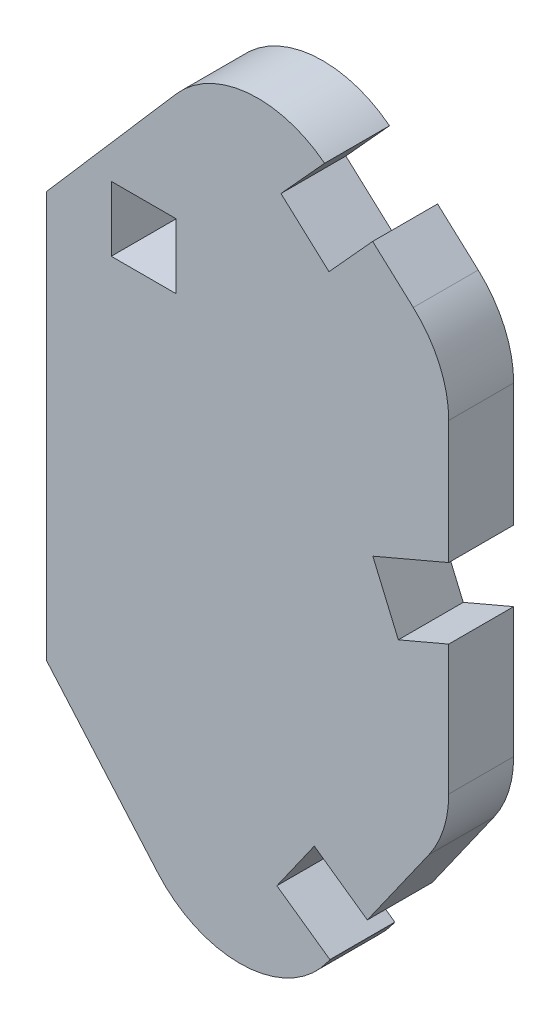
ISO-10303-21;
HEADER;
FILE_DESCRIPTION(('STEP AP214'),'2;1');
FILE_NAME('part.step','',(''),(''),'','','');
FILE_SCHEMA(('AUTOMOTIVE_DESIGN { 1 0 10303 214 1 1 1 1 }'));
ENDSEC;
DATA;
#1=APPLICATION_CONTEXT('core data for automotive mechanical design processes');
#2=APPLICATION_PROTOCOL_DEFINITION('international standard','automotive_design',2000,#1);
#3=PRODUCT_CONTEXT('',#1,'mechanical');
#4=PRODUCT('Part','Part','',(#3));
#5=PRODUCT_RELATED_PRODUCT_CATEGORY('part','',(#4));
#6=PRODUCT_DEFINITION_FORMATION('','',#4);
#7=PRODUCT_DEFINITION_CONTEXT('part definition',#1,'design');
#8=PRODUCT_DEFINITION('design','',#6,#7);
#9=PRODUCT_DEFINITION_SHAPE('','',#8);
#10=(LENGTH_UNIT() NAMED_UNIT(*) SI_UNIT(.MILLI.,.METRE.));
#11=(NAMED_UNIT(*) PLANE_ANGLE_UNIT() SI_UNIT($,.RADIAN.));
#12=(NAMED_UNIT(*) SI_UNIT($,.STERADIAN.) SOLID_ANGLE_UNIT());
#13=UNCERTAINTY_MEASURE_WITH_UNIT(LENGTH_MEASURE(1.E-05),#10,'distance_accuracy_value','');
#14=(GEOMETRIC_REPRESENTATION_CONTEXT(3) GLOBAL_UNCERTAINTY_ASSIGNED_CONTEXT((#13)) GLOBAL_UNIT_ASSIGNED_CONTEXT((#10,
#11,#12)) REPRESENTATION_CONTEXT('',''));
#15=CARTESIAN_POINT('',(0.,0.,0.));
#16=DIRECTION('',(0.,0.,1.));
#17=DIRECTION('',(1.,0.,0.));
#18=AXIS2_PLACEMENT_3D('',#15,#16,#17);
#19=CARTESIAN_POINT('',(0.,0.,-1.524));
#20=DIRECTION('',(0.,0.,1.));
#21=DIRECTION('',(-1.,0.,0.));
#22=AXIS2_PLACEMENT_3D('',#19,#20,#21);
#23=PLANE('',#22);
#24=DIRECTION('',(0.655594715544855,-0.755112951120334,0.));
#25=VECTOR('',#24,1.);
#26=CARTESIAN_POINT('',(1.524,-10.4973080234893,-1.524));
#27=LINE('',#26,#25);
#28=CARTESIAN_POINT('',(1.524,-10.4973080234893,-1.524));
#29=VERTEX_POINT('',#28);
#30=CARTESIAN_POINT('',(4.14460846819319,-13.5157206909918,-1.524));
#31=VERTEX_POINT('',#30);
#32=EDGE_CURVE('E241',#29,#31,#27,.T.);
#33=ORIENTED_EDGE('',*,*,#32,.F.);
#34=DIRECTION('',(0.,-1.,0.));
#35=VECTOR('',#34,1.);
#36=CARTESIAN_POINT('',(1.524,-10.4973080234893,-1.524));
#37=LINE('',#36,#35);
#38=CARTESIAN_POINT('',(1.524,-0.972308023489268,-1.524));
#39=VERTEX_POINT('',#38);
#40=EDGE_CURVE('E288',#39,#29,#37,.T.);
#41=ORIENTED_EDGE('',*,*,#40,.F.);
#42=DIRECTION('',(-0.655594715544855,-0.755112951120334,0.));
#43=VECTOR('',#42,1.);
#44=CARTESIAN_POINT('',(1.524,-0.972308023489268,-1.524));
#45=LINE('',#44,#43);
#46=CARTESIAN_POINT('',(4.57080902595248,2.53700176887991,-1.524));
#47=VERTEX_POINT('',#46);
#48=EDGE_CURVE('E286',#47,#39,#45,.T.);
#49=ORIENTED_EDGE('',*,*,#48,.F.);
#50=CARTESIAN_POINT('',(6.48879592179813,0.87179119139598,-1.524));
#51=DIRECTION('',(0.,0.,-1.));
#52=DIRECTION('',(-1.,0.,0.));
#53=AXIS2_PLACEMENT_3D('',#50,#51,#52);
#54=CIRCLE('',#53,2.54);
#55=CARTESIAN_POINT('',(8.05554168634904,2.8710179692433,-1.524));
#56=VERTEX_POINT('',#55);
#57=EDGE_CURVE('E386',#56,#47,#54,.F.);
#58=ORIENTED_EDGE('',*,*,#57,.F.);
#59=DIRECTION('',(0.672440925260352,0.740150796821162,0.));
#60=VECTOR('',#59,1.);
#61=CARTESIAN_POINT('',(8.05554168634904,2.8710179692433,-1.524));
#62=LINE('',#61,#60);
#63=CARTESIAN_POINT('',(7.03074171625227,1.74302815488784,-1.524));
#64=VERTEX_POINT('',#63);
#65=EDGE_CURVE('E283',#64,#56,#62,.T.);
#66=ORIENTED_EDGE('',*,*,#65,.F.);
#67=DIRECTION('',(-0.740150796821163,0.672440925260351,0.));
#68=VECTOR('',#67,1.);
#69=CARTESIAN_POINT('',(7.03074171625227,1.74302815488784,-1.524));
#70=LINE('',#69,#68);
#71=CARTESIAN_POINT('',(8.15873153060772,0.718228184791068,-1.524));
#72=VERTEX_POINT('',#71);
#73=EDGE_CURVE('E280',#72,#64,#70,.T.);
#74=ORIENTED_EDGE('',*,*,#73,.F.);
#75=DIRECTION('',(-0.672440925260352,-0.740150796821163,0.));
#76=VECTOR('',#75,1.);
#77=CARTESIAN_POINT('',(9.1835315007045,1.84621799914652,-1.524));
#78=LINE('',#77,#76);
#79=CARTESIAN_POINT('',(9.1835315007045,1.84621799914652,-1.524));
#80=VERTEX_POINT('',#79);
#81=EDGE_CURVE('E277',#80,#72,#78,.T.);
#82=ORIENTED_EDGE('',*,*,#81,.F.);
#83=DIRECTION('',(-0.740150796821161,0.672440925260353,0.));
#84=VECTOR('',#83,1.);
#85=CARTESIAN_POINT('',(9.1835315007045,1.84621799914652,-1.524));
#86=LINE('',#85,#84);
#87=CARTESIAN_POINT('',(10.1375153235953,0.979505746314785,-1.524));
#88=VERTEX_POINT('',#87);
#89=EDGE_CURVE('E275',#88,#80,#86,.T.);
#90=ORIENTED_EDGE('',*,*,#89,.F.);
#91=CARTESIAN_POINT('',(8.42951537343396,-0.900477277610966,-1.524));
#92=DIRECTION('',(0.,0.,-1.));
#93=DIRECTION('',(-1.,0.,0.));
#94=AXIS2_PLACEMENT_3D('',#91,#92,#93);
#95=CIRCLE('',#94,2.54);
#96=CARTESIAN_POINT('',(10.969515373434,-0.900477277610966,-1.524));
#97=VERTEX_POINT('',#96);
#98=EDGE_CURVE('E384',#97,#88,#95,.F.);
#99=ORIENTED_EDGE('',*,*,#98,.F.);
#100=DIRECTION('',(0.,1.,0.));
#101=VECTOR('',#100,1.);
#102=CARTESIAN_POINT('',(10.969515373434,-3.78982146589221,-1.524));
#103=LINE('',#102,#101);
#104=CARTESIAN_POINT('',(10.969515373434,-3.78982146589221,-1.524));
#105=VERTEX_POINT('',#104);
#106=EDGE_CURVE('E272',#105,#97,#103,.T.);
#107=ORIENTED_EDGE('',*,*,#106,.F.);
#108=DIRECTION('',(0.919781846056085,0.392430064681162,0.));
#109=VECTOR('',#108,1.);
#110=CARTESIAN_POINT('',(10.969515373434,-3.78982146589221,-1.524));
#111=LINE('',#110,#109);
#112=CARTESIAN_POINT('',(9.18820201833848,-4.54982876344319,-1.524));
#113=VERTEX_POINT('',#112);
#114=EDGE_CURVE('E269',#113,#105,#111,.T.);
#115=ORIENTED_EDGE('',*,*,#114,.F.);
#116=DIRECTION('',(-0.392430064681162,0.919781846056084,0.));
#117=VECTOR('',#116,1.);
#118=CARTESIAN_POINT('',(9.18820201833848,-4.54982876344319,-1.524));
#119=LINE('',#118,#117);
#120=CARTESIAN_POINT('',(9.78626543691257,-5.95157629683267,-1.524));
#121=VERTEX_POINT('',#120);
#122=EDGE_CURVE('E266',#121,#113,#119,.T.);
#123=ORIENTED_EDGE('',*,*,#122,.F.);
#124=DIRECTION('',(-0.919781846056085,-0.392430064681162,0.));
#125=VECTOR('',#124,1.);
#126=CARTESIAN_POINT('',(9.78626543691257,-5.95157629683267,-1.524));
#127=LINE('',#126,#125);
#128=CARTESIAN_POINT('',(10.969515373434,-5.44673609900302,-1.524));
#129=VERTEX_POINT('',#128);
#130=EDGE_CURVE('E263',#129,#121,#127,.T.);
#131=ORIENTED_EDGE('',*,*,#130,.F.);
#132=DIRECTION('',(0.,1.,0.));
#133=VECTOR('',#132,1.);
#134=CARTESIAN_POINT('',(10.969515373434,-9.30138195350672,-1.524));
#135=LINE('',#134,#133);
#136=CARTESIAN_POINT('',(10.969515373434,-8.49557113073387,-1.524));
#137=VERTEX_POINT('',#136);
#138=EDGE_CURVE('E260',#137,#129,#135,.T.);
#139=ORIENTED_EDGE('',*,*,#138,.F.);
#140=CARTESIAN_POINT('',(8.42951537343396,-8.49557113073387,-1.524));
#141=DIRECTION('',(0.,0.,-1.));
#142=DIRECTION('',(-1.,0.,0.));
#143=AXIS2_PLACEMENT_3D('',#140,#141,#142);
#144=CIRCLE('',#143,2.54);
#145=CARTESIAN_POINT('',(10.5049844747504,-9.95982111262931,-1.524));
#146=VERTEX_POINT('',#145);
#147=EDGE_CURVE('E388',#146,#137,#144,.F.);
#148=ORIENTED_EDGE('',*,*,#147,.F.);
#149=DIRECTION('',(0.576476370824979,0.817113819415913,0.));
#150=VECTOR('',#149,1.);
#151=CARTESIAN_POINT('',(9.0588115880954,-12.009667230796,-1.524));
#152=LINE('',#151,#150);
#153=CARTESIAN_POINT('',(9.0588115880954,-12.009667230796,-1.524));
#154=VERTEX_POINT('',#153);
#155=EDGE_CURVE('E257',#154,#146,#152,.T.);
#156=ORIENTED_EDGE('',*,*,#155,.F.);
#157=DIRECTION('',(0.817113819415912,-0.57647637082498,0.));
#158=VECTOR('',#157,1.);
#159=CARTESIAN_POINT('',(9.0588115880954,-12.009667230796,-1.524));
#160=LINE('',#159,#158);
#161=CARTESIAN_POINT('',(7.81353012730556,-11.1311172416587,-1.524));
#162=VERTEX_POINT('',#161);
#163=EDGE_CURVE('E254',#162,#154,#160,.T.);
#164=ORIENTED_EDGE('',*,*,#163,.F.);
#165=DIRECTION('',(0.57647637082498,0.817113819415913,0.));
#166=VECTOR('',#165,1.);
#167=CARTESIAN_POINT('',(7.81353012730556,-11.1311172416587,-1.524));
#168=LINE('',#167,#166);
#169=CARTESIAN_POINT('',(6.93498013816829,-12.3763987024485,-1.524));
#170=VERTEX_POINT('',#169);
#171=EDGE_CURVE('E251',#170,#162,#168,.T.);
#172=ORIENTED_EDGE('',*,*,#171,.F.);
#173=DIRECTION('',(-0.817113819415912,0.57647637082498,0.));
#174=VECTOR('',#173,1.);
#175=CARTESIAN_POINT('',(8.18026159895814,-13.2549486915858,-1.524));
#176=LINE('',#175,#174);
#177=CARTESIAN_POINT('',(8.18026159895814,-13.2549486915858,-1.524));
#178=VERTEX_POINT('',#177);
#179=EDGE_CURVE('E248',#178,#170,#176,.T.);
#180=ORIENTED_EDGE('',*,*,#179,.F.);
#181=DIRECTION('',(0.576476370824979,0.817113819415913,0.));
#182=VECTOR('',#181,1.);
#183=CARTESIAN_POINT('',(6.26955781361958,-15.9632339688751,-1.524));
#184=LINE('',#183,#182);
#185=CARTESIAN_POINT('',(8.13806446535526,-13.3147600954033,-1.524));
#186=VERTEX_POINT('',#185);
#187=EDGE_CURVE('E244',#186,#178,#184,.T.);
#188=ORIENTED_EDGE('',*,*,#187,.F.);
#189=CARTESIAN_POINT('',(6.06259536403884,-11.8505101135079,-1.524));
#190=DIRECTION('',(0.,0.,-1.));
#191=DIRECTION('',(-1.,0.,0.));
#192=AXIS2_PLACEMENT_3D('',#189,#190,#191);
#193=CIRCLE('',#192,2.54);
#194=EDGE_CURVE('E391',#31,#186,#193,.F.);
#195=ORIENTED_EDGE('',*,*,#194,.F.);
#196=EDGE_LOOP('',(#33,#41,#49,#58,#66,#74,#82,#90,#99,#107,#115,#123,#131,#139,#148,#156,#164,
#172,#180,#188,#195));
#197=FACE_BOUND('',#196,.T.);
#198=DIRECTION('',(0.,1.,0.));
#199=VECTOR('',#198,1.);
#200=CARTESIAN_POINT('',(4.572,0.,-1.524));
#201=LINE('',#200,#199);
#202=CARTESIAN_POINT('',(4.572,-1.524,-1.524));
#203=VERTEX_POINT('',#202);
#204=CARTESIAN_POINT('',(4.572,0.,-1.524));
#205=VERTEX_POINT('',#204);
#206=EDGE_CURVE('E203',#203,#205,#201,.T.);
#207=ORIENTED_EDGE('',*,*,#206,.T.);
#208=DIRECTION('',(-1.,0.,0.));
#209=VECTOR('',#208,1.);
#210=CARTESIAN_POINT('',(4.572,0.,-1.524));
#211=LINE('',#210,#209);
#212=CARTESIAN_POINT('',(3.048,0.,-1.524));
#213=VERTEX_POINT('',#212);
#214=EDGE_CURVE('E213',#205,#213,#211,.T.);
#215=ORIENTED_EDGE('',*,*,#214,.T.);
#216=DIRECTION('',(0.,-1.,0.));
#217=VECTOR('',#216,1.);
#218=CARTESIAN_POINT('',(3.048,0.,-1.524));
#219=LINE('',#218,#217);
#220=CARTESIAN_POINT('',(3.048,-1.524,-1.524));
#221=VERTEX_POINT('',#220);
#222=EDGE_CURVE('E218',#213,#221,#219,.T.);
#223=ORIENTED_EDGE('',*,*,#222,.T.);
#224=DIRECTION('',(1.,0.,0.));
#225=VECTOR('',#224,1.);
#226=CARTESIAN_POINT('',(4.572,-1.524,-1.524));
#227=LINE('',#226,#225);
#228=EDGE_CURVE('E222',#221,#203,#227,.T.);
#229=ORIENTED_EDGE('',*,*,#228,.T.);
#230=EDGE_LOOP('',(#207,#215,#223,#229));
#231=FACE_BOUND('',#230,.T.);
#232=ADVANCED_FACE('F32',(#197,#231),#23,.F.);
#233=CARTESIAN_POINT('',(0.,0.,0.));
#234=DIRECTION('',(0.,0.,1.));
#235=DIRECTION('',(-1.,0.,0.));
#236=AXIS2_PLACEMENT_3D('',#233,#234,#235);
#237=PLANE('',#236);
#238=DIRECTION('',(0.576476370824979,0.817113819415913,0.));
#239=VECTOR('',#238,1.);
#240=CARTESIAN_POINT('',(6.26955781361958,-15.9632339688751,0.));
#241=LINE('',#240,#239);
#242=CARTESIAN_POINT('',(8.13806446535526,-13.3147600954033,0.));
#243=VERTEX_POINT('',#242);
#244=CARTESIAN_POINT('',(8.18026159895814,-13.2549486915858,0.));
#245=VERTEX_POINT('',#244);
#246=EDGE_CURVE('E294',#243,#245,#241,.T.);
#247=ORIENTED_EDGE('',*,*,#246,.T.);
#248=DIRECTION('',(-0.817113819415912,0.57647637082498,0.));
#249=VECTOR('',#248,1.);
#250=CARTESIAN_POINT('',(8.18026159895814,-13.2549486915858,0.));
#251=LINE('',#250,#249);
#252=CARTESIAN_POINT('',(6.93498013816829,-12.3763987024485,0.));
#253=VERTEX_POINT('',#252);
#254=EDGE_CURVE('E297',#245,#253,#251,.T.);
#255=ORIENTED_EDGE('',*,*,#254,.T.);
#256=DIRECTION('',(0.57647637082498,0.817113819415913,0.));
#257=VECTOR('',#256,1.);
#258=CARTESIAN_POINT('',(7.81353012730556,-11.1311172416587,0.));
#259=LINE('',#258,#257);
#260=CARTESIAN_POINT('',(7.81353012730556,-11.1311172416587,0.));
#261=VERTEX_POINT('',#260);
#262=EDGE_CURVE('E300',#253,#261,#259,.T.);
#263=ORIENTED_EDGE('',*,*,#262,.T.);
#264=DIRECTION('',(0.817113819415912,-0.57647637082498,0.));
#265=VECTOR('',#264,1.);
#266=CARTESIAN_POINT('',(9.0588115880954,-12.009667230796,0.));
#267=LINE('',#266,#265);
#268=CARTESIAN_POINT('',(9.0588115880954,-12.009667230796,0.));
#269=VERTEX_POINT('',#268);
#270=EDGE_CURVE('E303',#261,#269,#267,.T.);
#271=ORIENTED_EDGE('',*,*,#270,.T.);
#272=DIRECTION('',(0.576476370824979,0.817113819415913,0.));
#273=VECTOR('',#272,1.);
#274=CARTESIAN_POINT('',(9.0588115880954,-12.009667230796,0.));
#275=LINE('',#274,#273);
#276=CARTESIAN_POINT('',(10.5049844747504,-9.95982111262931,0.));
#277=VERTEX_POINT('',#276);
#278=EDGE_CURVE('E306',#269,#277,#275,.T.);
#279=ORIENTED_EDGE('',*,*,#278,.T.);
#280=CARTESIAN_POINT('',(8.42951537343396,-8.49557113073387,0.));
#281=DIRECTION('',(0.,0.,-1.));
#282=DIRECTION('',(-1.,0.,0.));
#283=AXIS2_PLACEMENT_3D('',#280,#281,#282);
#284=CIRCLE('',#283,2.54);
#285=CARTESIAN_POINT('',(10.969515373434,-8.49557113073387,0.));
#286=VERTEX_POINT('',#285);
#287=EDGE_CURVE('E376',#286,#277,#284,.T.);
#288=ORIENTED_EDGE('',*,*,#287,.F.);
#289=DIRECTION('',(0.,1.,0.));
#290=VECTOR('',#289,1.);
#291=CARTESIAN_POINT('',(10.969515373434,-9.30138195350672,0.));
#292=LINE('',#291,#290);
#293=CARTESIAN_POINT('',(10.969515373434,-5.44673609900302,0.));
#294=VERTEX_POINT('',#293);
#295=EDGE_CURVE('E309',#286,#294,#292,.T.);
#296=ORIENTED_EDGE('',*,*,#295,.T.);
#297=DIRECTION('',(-0.919781846056085,-0.392430064681162,0.));
#298=VECTOR('',#297,1.);
#299=CARTESIAN_POINT('',(9.78626543691257,-5.95157629683267,0.));
#300=LINE('',#299,#298);
#301=CARTESIAN_POINT('',(9.78626543691257,-5.95157629683267,0.));
#302=VERTEX_POINT('',#301);
#303=EDGE_CURVE('E312',#294,#302,#300,.T.);
#304=ORIENTED_EDGE('',*,*,#303,.T.);
#305=DIRECTION('',(-0.392430064681162,0.919781846056084,0.));
#306=VECTOR('',#305,1.);
#307=CARTESIAN_POINT('',(9.18820201833848,-4.54982876344319,0.));
#308=LINE('',#307,#306);
#309=CARTESIAN_POINT('',(9.18820201833848,-4.54982876344319,0.));
#310=VERTEX_POINT('',#309);
#311=EDGE_CURVE('E315',#302,#310,#308,.T.);
#312=ORIENTED_EDGE('',*,*,#311,.T.);
#313=DIRECTION('',(0.919781846056085,0.392430064681162,0.));
#314=VECTOR('',#313,1.);
#315=CARTESIAN_POINT('',(10.969515373434,-3.78982146589221,0.));
#316=LINE('',#315,#314);
#317=CARTESIAN_POINT('',(10.969515373434,-3.78982146589221,0.));
#318=VERTEX_POINT('',#317);
#319=EDGE_CURVE('E318',#310,#318,#316,.T.);
#320=ORIENTED_EDGE('',*,*,#319,.T.);
#321=DIRECTION('',(0.,1.,0.));
#322=VECTOR('',#321,1.);
#323=CARTESIAN_POINT('',(10.969515373434,-3.78982146589221,0.));
#324=LINE('',#323,#322);
#325=CARTESIAN_POINT('',(10.969515373434,-0.900477277610966,0.));
#326=VERTEX_POINT('',#325);
#327=EDGE_CURVE('E321',#318,#326,#324,.T.);
#328=ORIENTED_EDGE('',*,*,#327,.T.);
#329=CARTESIAN_POINT('',(8.42951537343396,-0.900477277610966,0.));
#330=DIRECTION('',(0.,0.,-1.));
#331=DIRECTION('',(-1.,0.,0.));
#332=AXIS2_PLACEMENT_3D('',#329,#330,#331);
#333=CIRCLE('',#332,2.54);
#334=CARTESIAN_POINT('',(10.1375153235953,0.979505746314785,0.));
#335=VERTEX_POINT('',#334);
#336=EDGE_CURVE('E370',#335,#326,#333,.T.);
#337=ORIENTED_EDGE('',*,*,#336,.F.);
#338=DIRECTION('',(-0.740150796821161,0.672440925260353,0.));
#339=VECTOR('',#338,1.);
#340=CARTESIAN_POINT('',(9.1835315007045,1.84621799914652,0.));
#341=LINE('',#340,#339);
#342=CARTESIAN_POINT('',(9.1835315007045,1.84621799914652,0.));
#343=VERTEX_POINT('',#342);
#344=EDGE_CURVE('E324',#335,#343,#341,.T.);
#345=ORIENTED_EDGE('',*,*,#344,.T.);
#346=DIRECTION('',(-0.672440925260352,-0.740150796821163,0.));
#347=VECTOR('',#346,1.);
#348=CARTESIAN_POINT('',(9.1835315007045,1.84621799914652,0.));
#349=LINE('',#348,#347);
#350=CARTESIAN_POINT('',(8.15873153060772,0.718228184791068,0.));
#351=VERTEX_POINT('',#350);
#352=EDGE_CURVE('E327',#343,#351,#349,.T.);
#353=ORIENTED_EDGE('',*,*,#352,.T.);
#354=DIRECTION('',(-0.740150796821163,0.672440925260351,0.));
#355=VECTOR('',#354,1.);
#356=CARTESIAN_POINT('',(7.03074171625227,1.74302815488784,0.));
#357=LINE('',#356,#355);
#358=CARTESIAN_POINT('',(7.03074171625227,1.74302815488784,0.));
#359=VERTEX_POINT('',#358);
#360=EDGE_CURVE('E330',#351,#359,#357,.T.);
#361=ORIENTED_EDGE('',*,*,#360,.T.);
#362=DIRECTION('',(0.672440925260352,0.740150796821162,0.));
#363=VECTOR('',#362,1.);
#364=CARTESIAN_POINT('',(8.05554168634904,2.8710179692433,0.));
#365=LINE('',#364,#363);
#366=CARTESIAN_POINT('',(8.05554168634904,2.8710179692433,0.));
#367=VERTEX_POINT('',#366);
#368=EDGE_CURVE('E333',#359,#367,#365,.T.);
#369=ORIENTED_EDGE('',*,*,#368,.T.);
#370=CARTESIAN_POINT('',(6.48879592179813,0.87179119139598,0.));
#371=DIRECTION('',(0.,0.,-1.));
#372=DIRECTION('',(-1.,0.,0.));
#373=AXIS2_PLACEMENT_3D('',#370,#371,#372);
#374=CIRCLE('',#373,2.54);
#375=CARTESIAN_POINT('',(4.57080902595248,2.53700176887991,0.));
#376=VERTEX_POINT('',#375);
#377=EDGE_CURVE('E373',#376,#367,#374,.T.);
#378=ORIENTED_EDGE('',*,*,#377,.F.);
#379=DIRECTION('',(-0.655594715544855,-0.755112951120334,0.));
#380=VECTOR('',#379,1.);
#381=CARTESIAN_POINT('',(1.524,-0.972308023489268,0.));
#382=LINE('',#381,#380);
#383=CARTESIAN_POINT('',(1.524,-0.972308023489268,0.));
#384=VERTEX_POINT('',#383);
#385=EDGE_CURVE('E336',#376,#384,#382,.T.);
#386=ORIENTED_EDGE('',*,*,#385,.T.);
#387=DIRECTION('',(0.,-1.,0.));
#388=VECTOR('',#387,1.);
#389=CARTESIAN_POINT('',(1.524,-10.4973080234893,0.));
#390=LINE('',#389,#388);
#391=CARTESIAN_POINT('',(1.524,-10.4973080234893,0.));
#392=VERTEX_POINT('',#391);
#393=EDGE_CURVE('E245',#384,#392,#390,.T.);
#394=ORIENTED_EDGE('',*,*,#393,.T.);
#395=DIRECTION('',(0.655594715544855,-0.755112951120334,0.));
#396=VECTOR('',#395,1.);
#397=CARTESIAN_POINT('',(1.524,-10.4973080234893,0.));
#398=LINE('',#397,#396);
#399=CARTESIAN_POINT('',(4.14460846819319,-13.5157206909918,0.));
#400=VERTEX_POINT('',#399);
#401=EDGE_CURVE('E209',#392,#400,#398,.T.);
#402=ORIENTED_EDGE('',*,*,#401,.T.);
#403=CARTESIAN_POINT('',(6.06259536403884,-11.8505101135079,0.));
#404=DIRECTION('',(0.,0.,-1.));
#405=DIRECTION('',(-1.,0.,0.));
#406=AXIS2_PLACEMENT_3D('',#403,#404,#405);
#407=CIRCLE('',#406,2.54);
#408=EDGE_CURVE('E379',#243,#400,#407,.T.);
#409=ORIENTED_EDGE('',*,*,#408,.F.);
#410=EDGE_LOOP('',(#247,#255,#263,#271,#279,#288,#296,#304,#312,#320,#328,#337,#345,#353,#361,
#369,#378,#386,#394,#402,#409));
#411=FACE_BOUND('',#410,.T.);
#412=DIRECTION('',(1.,0.,0.));
#413=VECTOR('',#412,1.);
#414=CARTESIAN_POINT('',(4.572,-1.524,0.));
#415=LINE('',#414,#413);
#416=CARTESIAN_POINT('',(3.048,-1.524,0.));
#417=VERTEX_POINT('',#416);
#418=CARTESIAN_POINT('',(4.572,-1.524,0.));
#419=VERTEX_POINT('',#418);
#420=EDGE_CURVE('E223',#417,#419,#415,.T.);
#421=ORIENTED_EDGE('',*,*,#420,.F.);
#422=DIRECTION('',(0.,-1.,0.));
#423=VECTOR('',#422,1.);
#424=CARTESIAN_POINT('',(3.048,0.,0.));
#425=LINE('',#424,#423);
#426=CARTESIAN_POINT('',(3.048,0.,0.));
#427=VERTEX_POINT('',#426);
#428=EDGE_CURVE('E226',#427,#417,#425,.T.);
#429=ORIENTED_EDGE('',*,*,#428,.F.);
#430=DIRECTION('',(-1.,0.,0.));
#431=VECTOR('',#430,1.);
#432=CARTESIAN_POINT('',(4.572,0.,0.));
#433=LINE('',#432,#431);
#434=CARTESIAN_POINT('',(4.572,0.,0.));
#435=VERTEX_POINT('',#434);
#436=EDGE_CURVE('E233',#435,#427,#433,.T.);
#437=ORIENTED_EDGE('',*,*,#436,.F.);
#438=DIRECTION('',(0.,1.,0.));
#439=VECTOR('',#438,1.);
#440=CARTESIAN_POINT('',(4.572,0.,0.));
#441=LINE('',#440,#439);
#442=EDGE_CURVE('E205',#419,#435,#441,.T.);
#443=ORIENTED_EDGE('',*,*,#442,.F.);
#444=EDGE_LOOP('',(#421,#429,#437,#443));
#445=FACE_BOUND('',#444,.T.);
#446=ADVANCED_FACE('F405',(#411,#445),#237,.T.);
#447=CARTESIAN_POINT('',(1.524,-10.4973080234893,-1.524));
#448=DIRECTION('',(0.755112951120334,0.655594715544855,0.));
#449=DIRECTION('',(-0.655594715544855,0.755112951120334,0.));
#450=AXIS2_PLACEMENT_3D('',#447,#448,#449);
#451=PLANE('',#450);
#452=ORIENTED_EDGE('',*,*,#401,.F.);
#453=DIRECTION('',(0.,0.,1.));
#454=VECTOR('',#453,1.);
#455=CARTESIAN_POINT('',(1.524,-10.4973080234893,-1.524));
#456=LINE('',#455,#454);
#457=EDGE_CURVE('E291',#29,#392,#456,.T.);
#458=ORIENTED_EDGE('',*,*,#457,.F.);
#459=ORIENTED_EDGE('',*,*,#32,.T.);
#460=DIRECTION('',(0.,0.,1.));
#461=VECTOR('',#460,1.);
#462=CARTESIAN_POINT('',(4.14460846819319,-13.5157206909918,-1.524));
#463=LINE('',#462,#461);
#464=EDGE_CURVE('E382',#400,#31,#463,.F.);
#465=ORIENTED_EDGE('',*,*,#464,.F.);
#466=EDGE_LOOP('',(#452,#458,#459,#465));
#467=FACE_BOUND('',#466,.T.);
#468=ADVANCED_FACE('F438',(#467),#451,.F.);
#469=CARTESIAN_POINT('',(6.26955781361958,-15.9632339688751,-1.524));
#470=DIRECTION('',(-0.817113819415913,0.576476370824979,0.));
#471=DIRECTION('',(-0.576476370824979,-0.817113819415913,0.));
#472=AXIS2_PLACEMENT_3D('',#469,#470,#471);
#473=PLANE('',#472);
#474=ORIENTED_EDGE('',*,*,#187,.T.);
#475=DIRECTION('',(0.,0.,1.));
#476=VECTOR('',#475,1.);
#477=CARTESIAN_POINT('',(8.18026159895814,-13.2549486915858,-1.524));
#478=LINE('',#477,#476);
#479=EDGE_CURVE('E366',#178,#245,#478,.T.);
#480=ORIENTED_EDGE('',*,*,#479,.T.);
#481=ORIENTED_EDGE('',*,*,#246,.F.);
#482=DIRECTION('',(0.,0.,1.));
#483=VECTOR('',#482,1.);
#484=CARTESIAN_POINT('',(8.13806446535526,-13.3147600954033,-1.524));
#485=LINE('',#484,#483);
#486=EDGE_CURVE('E368',#186,#243,#485,.T.);
#487=ORIENTED_EDGE('',*,*,#486,.F.);
#488=EDGE_LOOP('',(#474,#480,#481,#487));
#489=FACE_BOUND('',#488,.T.);
#490=ADVANCED_FACE('F443',(#489),#473,.F.);
#491=CARTESIAN_POINT('',(8.18026159895814,-13.2549486915858,-1.524));
#492=DIRECTION('',(-0.57647637082498,-0.817113819415912,0.));
#493=DIRECTION('',(0.817113819415913,-0.57647637082498,0.));
#494=AXIS2_PLACEMENT_3D('',#491,#492,#493);
#495=PLANE('',#494);
#496=ORIENTED_EDGE('',*,*,#254,.F.);
#497=ORIENTED_EDGE('',*,*,#479,.F.);
#498=ORIENTED_EDGE('',*,*,#179,.T.);
#499=DIRECTION('',(0.,0.,1.));
#500=VECTOR('',#499,1.);
#501=CARTESIAN_POINT('',(6.93498013816829,-12.3763987024485,-1.524));
#502=LINE('',#501,#500);
#503=EDGE_CURVE('E364',#170,#253,#502,.T.);
#504=ORIENTED_EDGE('',*,*,#503,.T.);
#505=EDGE_LOOP('',(#496,#497,#498,#504));
#506=FACE_BOUND('',#505,.T.);
#507=ADVANCED_FACE('F448',(#506),#495,.F.);
#508=CARTESIAN_POINT('',(7.81353012730556,-11.1311172416587,-1.524));
#509=DIRECTION('',(-0.817113819415913,0.57647637082498,0.));
#510=DIRECTION('',(-0.57647637082498,-0.817113819415913,0.));
#511=AXIS2_PLACEMENT_3D('',#508,#509,#510);
#512=PLANE('',#511);
#513=ORIENTED_EDGE('',*,*,#262,.F.);
#514=ORIENTED_EDGE('',*,*,#503,.F.);
#515=ORIENTED_EDGE('',*,*,#171,.T.);
#516=DIRECTION('',(0.,0.,1.));
#517=VECTOR('',#516,1.);
#518=CARTESIAN_POINT('',(7.81353012730556,-11.1311172416587,-1.524));
#519=LINE('',#518,#517);
#520=EDGE_CURVE('E362',#162,#261,#519,.T.);
#521=ORIENTED_EDGE('',*,*,#520,.T.);
#522=EDGE_LOOP('',(#513,#514,#515,#521));
#523=FACE_BOUND('',#522,.T.);
#524=ADVANCED_FACE('F452',(#523),#512,.F.);
#525=CARTESIAN_POINT('',(9.0588115880954,-12.009667230796,-1.524));
#526=DIRECTION('',(0.57647637082498,0.817113819415912,0.));
#527=DIRECTION('',(-0.817113819415912,0.57647637082498,0.));
#528=AXIS2_PLACEMENT_3D('',#525,#526,#527);
#529=PLANE('',#528);
#530=ORIENTED_EDGE('',*,*,#270,.F.);
#531=ORIENTED_EDGE('',*,*,#520,.F.);
#532=ORIENTED_EDGE('',*,*,#163,.T.);
#533=DIRECTION('',(0.,0.,1.));
#534=VECTOR('',#533,1.);
#535=CARTESIAN_POINT('',(9.0588115880954,-12.009667230796,-1.524));
#536=LINE('',#535,#534);
#537=EDGE_CURVE('E360',#154,#269,#536,.T.);
#538=ORIENTED_EDGE('',*,*,#537,.T.);
#539=EDGE_LOOP('',(#530,#531,#532,#538));
#540=FACE_BOUND('',#539,.T.);
#541=ADVANCED_FACE('F456',(#540),#529,.F.);
#542=CARTESIAN_POINT('',(9.0588115880954,-12.009667230796,-1.524));
#543=DIRECTION('',(-0.817113819415913,0.576476370824979,0.));
#544=DIRECTION('',(-0.576476370824979,-0.817113819415913,0.));
#545=AXIS2_PLACEMENT_3D('',#542,#543,#544);
#546=PLANE('',#545);
#547=ORIENTED_EDGE('',*,*,#278,.F.);
#548=ORIENTED_EDGE('',*,*,#537,.F.);
#549=ORIENTED_EDGE('',*,*,#155,.T.);
#550=DIRECTION('',(0.,0.,1.));
#551=VECTOR('',#550,1.);
#552=CARTESIAN_POINT('',(10.5049844747504,-9.95982111262931,-1.524));
#553=LINE('',#552,#551);
#554=EDGE_CURVE('E396',#277,#146,#553,.F.);
#555=ORIENTED_EDGE('',*,*,#554,.F.);
#556=EDGE_LOOP('',(#547,#548,#549,#555));
#557=FACE_BOUND('',#556,.T.);
#558=ADVANCED_FACE('F460',(#557),#546,.F.);
#559=CARTESIAN_POINT('',(10.969515373434,-9.30138195350672,-1.524));
#560=DIRECTION('',(-1.,0.,0.));
#561=DIRECTION('',(0.,0.,-1.));
#562=AXIS2_PLACEMENT_3D('',#559,#560,#561);
#563=PLANE('',#562);
#564=ORIENTED_EDGE('',*,*,#138,.T.);
#565=DIRECTION('',(0.,0.,1.));
#566=VECTOR('',#565,1.);
#567=CARTESIAN_POINT('',(10.969515373434,-5.44673609900302,-1.524));
#568=LINE('',#567,#566);
#569=EDGE_CURVE('E358',#129,#294,#568,.T.);
#570=ORIENTED_EDGE('',*,*,#569,.T.);
#571=ORIENTED_EDGE('',*,*,#295,.F.);
#572=DIRECTION('',(0.,0.,1.));
#573=VECTOR('',#572,1.);
#574=CARTESIAN_POINT('',(10.969515373434,-8.49557113073387,-1.524));
#575=LINE('',#574,#573);
#576=EDGE_CURVE('E394',#137,#286,#575,.T.);
#577=ORIENTED_EDGE('',*,*,#576,.F.);
#578=EDGE_LOOP('',(#564,#570,#571,#577));
#579=FACE_BOUND('',#578,.T.);
#580=ADVANCED_FACE('F468',(#579),#563,.F.);
#581=CARTESIAN_POINT('',(9.78626543691257,-5.95157629683267,-1.524));
#582=DIRECTION('',(0.392430064681162,-0.919781846056084,0.));
#583=DIRECTION('',(0.919781846056085,0.392430064681162,0.));
#584=AXIS2_PLACEMENT_3D('',#581,#582,#583);
#585=PLANE('',#584);
#586=ORIENTED_EDGE('',*,*,#303,.F.);
#587=ORIENTED_EDGE('',*,*,#569,.F.);
#588=ORIENTED_EDGE('',*,*,#130,.T.);
#589=DIRECTION('',(0.,0.,1.));
#590=VECTOR('',#589,1.);
#591=CARTESIAN_POINT('',(9.78626543691257,-5.95157629683267,-1.524));
#592=LINE('',#591,#590);
#593=EDGE_CURVE('E356',#121,#302,#592,.T.);
#594=ORIENTED_EDGE('',*,*,#593,.T.);
#595=EDGE_LOOP('',(#586,#587,#588,#594));
#596=FACE_BOUND('',#595,.T.);
#597=ADVANCED_FACE('F472',(#596),#585,.F.);
#598=CARTESIAN_POINT('',(9.18820201833848,-4.54982876344319,-1.524));
#599=DIRECTION('',(-0.919781846056084,-0.392430064681162,0.));
#600=DIRECTION('',(0.392430064681162,-0.919781846056085,0.));
#601=AXIS2_PLACEMENT_3D('',#598,#599,#600);
#602=PLANE('',#601);
#603=ORIENTED_EDGE('',*,*,#311,.F.);
#604=ORIENTED_EDGE('',*,*,#593,.F.);
#605=ORIENTED_EDGE('',*,*,#122,.T.);
#606=DIRECTION('',(0.,0.,1.));
#607=VECTOR('',#606,1.);
#608=CARTESIAN_POINT('',(9.18820201833848,-4.54982876344319,-1.524));
#609=LINE('',#608,#607);
#610=EDGE_CURVE('E354',#113,#310,#609,.T.);
#611=ORIENTED_EDGE('',*,*,#610,.T.);
#612=EDGE_LOOP('',(#603,#604,#605,#611));
#613=FACE_BOUND('',#612,.T.);
#614=ADVANCED_FACE('F475',(#613),#602,.F.);
#615=CARTESIAN_POINT('',(10.969515373434,-3.78982146589221,-1.524));
#616=DIRECTION('',(-0.392430064681162,0.919781846056084,0.));
#617=DIRECTION('',(-0.919781846056085,-0.392430064681162,0.));
#618=AXIS2_PLACEMENT_3D('',#615,#616,#617);
#619=PLANE('',#618);
#620=ORIENTED_EDGE('',*,*,#319,.F.);
#621=ORIENTED_EDGE('',*,*,#610,.F.);
#622=ORIENTED_EDGE('',*,*,#114,.T.);
#623=DIRECTION('',(0.,0.,1.));
#624=VECTOR('',#623,1.);
#625=CARTESIAN_POINT('',(10.969515373434,-3.78982146589221,-1.524));
#626=LINE('',#625,#624);
#627=EDGE_CURVE('E352',#105,#318,#626,.T.);
#628=ORIENTED_EDGE('',*,*,#627,.T.);
#629=EDGE_LOOP('',(#620,#621,#622,#628));
#630=FACE_BOUND('',#629,.T.);
#631=ADVANCED_FACE('F478',(#630),#619,.F.);
#632=CARTESIAN_POINT('',(10.969515373434,-3.78982146589221,-1.524));
#633=DIRECTION('',(-1.,0.,0.));
#634=DIRECTION('',(0.,0.,-1.));
#635=AXIS2_PLACEMENT_3D('',#632,#633,#634);
#636=PLANE('',#635);
#637=ORIENTED_EDGE('',*,*,#327,.F.);
#638=ORIENTED_EDGE('',*,*,#627,.F.);
#639=ORIENTED_EDGE('',*,*,#106,.T.);
#640=DIRECTION('',(0.,0.,1.));
#641=VECTOR('',#640,1.);
#642=CARTESIAN_POINT('',(10.969515373434,-0.900477277610966,-1.524));
#643=LINE('',#642,#641);
#644=EDGE_CURVE('E11',#326,#97,#643,.F.);
#645=ORIENTED_EDGE('',*,*,#644,.F.);
#646=EDGE_LOOP('',(#637,#638,#639,#645));
#647=FACE_BOUND('',#646,.T.);
#648=ADVANCED_FACE('F410',(#647),#636,.F.);
#649=CARTESIAN_POINT('',(9.1835315007045,1.84621799914652,-1.524));
#650=DIRECTION('',(-0.672440925260353,-0.740150796821161,0.));
#651=DIRECTION('',(0.740150796821161,-0.672440925260353,0.));
#652=AXIS2_PLACEMENT_3D('',#649,#650,#651);
#653=PLANE('',#652);
#654=ORIENTED_EDGE('',*,*,#89,.T.);
#655=DIRECTION('',(0.,0.,1.));
#656=VECTOR('',#655,1.);
#657=CARTESIAN_POINT('',(9.1835315007045,1.84621799914652,-1.524));
#658=LINE('',#657,#656);
#659=EDGE_CURVE('E350',#80,#343,#658,.T.);
#660=ORIENTED_EDGE('',*,*,#659,.T.);
#661=ORIENTED_EDGE('',*,*,#344,.F.);
#662=DIRECTION('',(0.,0.,1.));
#663=VECTOR('',#662,1.);
#664=CARTESIAN_POINT('',(10.1375153235953,0.979505746314784,-1.524));
#665=LINE('',#664,#663);
#666=EDGE_CURVE('E40',#88,#335,#665,.T.);
#667=ORIENTED_EDGE('',*,*,#666,.F.);
#668=EDGE_LOOP('',(#654,#660,#661,#667));
#669=FACE_BOUND('',#668,.T.);
#670=ADVANCED_FACE('F402',(#669),#653,.F.);
#671=CARTESIAN_POINT('',(9.1835315007045,1.84621799914652,-1.524));
#672=DIRECTION('',(0.740150796821163,-0.672440925260351,0.));
#673=DIRECTION('',(0.672440925260352,0.740150796821163,0.));
#674=AXIS2_PLACEMENT_3D('',#671,#672,#673);
#675=PLANE('',#674);
#676=ORIENTED_EDGE('',*,*,#352,.F.);
#677=ORIENTED_EDGE('',*,*,#659,.F.);
#678=ORIENTED_EDGE('',*,*,#81,.T.);
#679=DIRECTION('',(0.,0.,1.));
#680=VECTOR('',#679,1.);
#681=CARTESIAN_POINT('',(8.15873153060772,0.718228184791068,-1.524));
#682=LINE('',#681,#680);
#683=EDGE_CURVE('E348',#72,#351,#682,.T.);
#684=ORIENTED_EDGE('',*,*,#683,.T.);
#685=EDGE_LOOP('',(#676,#677,#678,#684));
#686=FACE_BOUND('',#685,.T.);
#687=ADVANCED_FACE('F419',(#686),#675,.F.);
#688=CARTESIAN_POINT('',(7.03074171625227,1.74302815488784,-1.524));
#689=DIRECTION('',(-0.672440925260351,-0.740150796821163,0.));
#690=DIRECTION('',(0.740150796821163,-0.672440925260352,0.));
#691=AXIS2_PLACEMENT_3D('',#688,#689,#690);
#692=PLANE('',#691);
#693=ORIENTED_EDGE('',*,*,#360,.F.);
#694=ORIENTED_EDGE('',*,*,#683,.F.);
#695=ORIENTED_EDGE('',*,*,#73,.T.);
#696=DIRECTION('',(0.,0.,1.));
#697=VECTOR('',#696,1.);
#698=CARTESIAN_POINT('',(7.03074171625227,1.74302815488784,-1.524));
#699=LINE('',#698,#697);
#700=EDGE_CURVE('E346',#64,#359,#699,.T.);
#701=ORIENTED_EDGE('',*,*,#700,.T.);
#702=EDGE_LOOP('',(#693,#694,#695,#701));
#703=FACE_BOUND('',#702,.T.);
#704=ADVANCED_FACE('F424',(#703),#692,.F.);
#705=CARTESIAN_POINT('',(8.05554168634904,2.8710179692433,-1.524));
#706=DIRECTION('',(-0.740150796821162,0.672440925260352,0.));
#707=DIRECTION('',(-0.672440925260352,-0.740150796821163,0.));
#708=AXIS2_PLACEMENT_3D('',#705,#706,#707);
#709=PLANE('',#708);
#710=ORIENTED_EDGE('',*,*,#368,.F.);
#711=ORIENTED_EDGE('',*,*,#700,.F.);
#712=ORIENTED_EDGE('',*,*,#65,.T.);
#713=DIRECTION('',(0.,0.,1.));
#714=VECTOR('',#713,1.);
#715=CARTESIAN_POINT('',(8.05554168634904,2.8710179692433,-1.524));
#716=LINE('',#715,#714);
#717=EDGE_CURVE('E344',#56,#367,#716,.T.);
#718=ORIENTED_EDGE('',*,*,#717,.T.);
#719=EDGE_LOOP('',(#710,#711,#712,#718));
#720=FACE_BOUND('',#719,.T.);
#721=ADVANCED_FACE('F426',(#720),#709,.F.);
#722=CARTESIAN_POINT('',(1.524,-0.972308023489268,-1.524));
#723=DIRECTION('',(0.755112951120334,-0.655594715544855,0.));
#724=DIRECTION('',(0.655594715544855,0.755112951120334,0.));
#725=AXIS2_PLACEMENT_3D('',#722,#723,#724);
#726=PLANE('',#725);
#727=ORIENTED_EDGE('',*,*,#48,.T.);
#728=DIRECTION('',(0.,0.,1.));
#729=VECTOR('',#728,1.);
#730=CARTESIAN_POINT('',(1.524,-0.972308023489268,-1.524));
#731=LINE('',#730,#729);
#732=EDGE_CURVE('E342',#39,#384,#731,.T.);
#733=ORIENTED_EDGE('',*,*,#732,.T.);
#734=ORIENTED_EDGE('',*,*,#385,.F.);
#735=DIRECTION('',(0.,0.,1.));
#736=VECTOR('',#735,1.);
#737=CARTESIAN_POINT('',(4.57080902595248,2.53700176887991,-1.524));
#738=LINE('',#737,#736);
#739=EDGE_CURVE('E47',#47,#376,#738,.T.);
#740=ORIENTED_EDGE('',*,*,#739,.F.);
#741=EDGE_LOOP('',(#727,#733,#734,#740));
#742=FACE_BOUND('',#741,.T.);
#743=ADVANCED_FACE('F431',(#742),#726,.F.);
#744=CARTESIAN_POINT('',(1.524,-10.4973080234893,-1.524));
#745=DIRECTION('',(1.,0.,0.));
#746=DIRECTION('',(0.,1.,0.));
#747=AXIS2_PLACEMENT_3D('',#744,#745,#746);
#748=PLANE('',#747);
#749=ORIENTED_EDGE('',*,*,#393,.F.);
#750=ORIENTED_EDGE('',*,*,#732,.F.);
#751=ORIENTED_EDGE('',*,*,#40,.T.);
#752=ORIENTED_EDGE('',*,*,#457,.T.);
#753=EDGE_LOOP('',(#749,#750,#751,#752));
#754=FACE_BOUND('',#753,.T.);
#755=ADVANCED_FACE('F435',(#754),#748,.F.);
#756=CARTESIAN_POINT('',(4.572,0.,-1.524));
#757=DIRECTION('',(-1.,0.,0.));
#758=DIRECTION('',(0.,0.,-1.));
#759=AXIS2_PLACEMENT_3D('',#756,#757,#758);
#760=PLANE('',#759);
#761=ORIENTED_EDGE('',*,*,#442,.T.);
#762=DIRECTION('',(0.,0.,1.));
#763=VECTOR('',#762,1.);
#764=CARTESIAN_POINT('',(4.572,0.,-1.524));
#765=LINE('',#764,#763);
#766=EDGE_CURVE('E199',#205,#435,#765,.T.);
#767=ORIENTED_EDGE('',*,*,#766,.F.);
#768=ORIENTED_EDGE('',*,*,#206,.F.);
#769=DIRECTION('',(0.,0.,1.));
#770=VECTOR('',#769,1.);
#771=CARTESIAN_POINT('',(4.572,-1.524,-1.524));
#772=LINE('',#771,#770);
#773=EDGE_CURVE('E231',#203,#419,#772,.T.);
#774=ORIENTED_EDGE('',*,*,#773,.T.);
#775=EDGE_LOOP('',(#761,#767,#768,#774));
#776=FACE_BOUND('',#775,.T.);
#777=ADVANCED_FACE('F201',(#776),#760,.T.);
#778=CARTESIAN_POINT('',(4.572,0.,-1.524));
#779=DIRECTION('',(0.,-1.,0.));
#780=DIRECTION('',(1.,0.,0.));
#781=AXIS2_PLACEMENT_3D('',#778,#779,#780);
#782=PLANE('',#781);
#783=ORIENTED_EDGE('',*,*,#436,.T.);
#784=DIRECTION('',(0.,0.,1.));
#785=VECTOR('',#784,1.);
#786=CARTESIAN_POINT('',(3.048,0.,-1.524));
#787=LINE('',#786,#785);
#788=EDGE_CURVE('E210',#213,#427,#787,.T.);
#789=ORIENTED_EDGE('',*,*,#788,.F.);
#790=ORIENTED_EDGE('',*,*,#214,.F.);
#791=ORIENTED_EDGE('',*,*,#766,.T.);
#792=EDGE_LOOP('',(#783,#789,#790,#791));
#793=FACE_BOUND('',#792,.T.);
#794=ADVANCED_FACE('F214',(#793),#782,.T.);
#795=CARTESIAN_POINT('',(3.048,0.,-1.524));
#796=DIRECTION('',(1.,0.,0.));
#797=DIRECTION('',(0.,0.,1.));
#798=AXIS2_PLACEMENT_3D('',#795,#796,#797);
#799=PLANE('',#798);
#800=ORIENTED_EDGE('',*,*,#428,.T.);
#801=DIRECTION('',(0.,0.,1.));
#802=VECTOR('',#801,1.);
#803=CARTESIAN_POINT('',(3.048,-1.524,-1.524));
#804=LINE('',#803,#802);
#805=EDGE_CURVE('E238',#221,#417,#804,.T.);
#806=ORIENTED_EDGE('',*,*,#805,.F.);
#807=ORIENTED_EDGE('',*,*,#222,.F.);
#808=ORIENTED_EDGE('',*,*,#788,.T.);
#809=EDGE_LOOP('',(#800,#806,#807,#808));
#810=FACE_BOUND('',#809,.T.);
#811=ADVANCED_FACE('F489',(#810),#799,.T.);
#812=CARTESIAN_POINT('',(4.572,-1.524,-1.524));
#813=DIRECTION('',(0.,1.,0.));
#814=DIRECTION('',(0.,0.,-1.));
#815=AXIS2_PLACEMENT_3D('',#812,#813,#814);
#816=PLANE('',#815);
#817=ORIENTED_EDGE('',*,*,#420,.T.);
#818=ORIENTED_EDGE('',*,*,#773,.F.);
#819=ORIENTED_EDGE('',*,*,#228,.F.);
#820=ORIENTED_EDGE('',*,*,#805,.T.);
#821=EDGE_LOOP('',(#817,#818,#819,#820));
#822=FACE_BOUND('',#821,.T.);
#823=ADVANCED_FACE('F482',(#822),#816,.T.);
#824=CARTESIAN_POINT('',(6.06259536403884,-11.8505101135079,-1.524));
#825=DIRECTION('',(0.,0.,1.));
#826=DIRECTION('',(-1.,0.,0.));
#827=AXIS2_PLACEMENT_3D('',#824,#825,#826);
#828=CYLINDRICAL_SURFACE('',#827,2.54);
#829=ORIENTED_EDGE('',*,*,#194,.T.);
#830=ORIENTED_EDGE('',*,*,#486,.T.);
#831=ORIENTED_EDGE('',*,*,#408,.T.);
#832=ORIENTED_EDGE('',*,*,#464,.T.);
#833=EDGE_LOOP('',(#829,#830,#831,#832));
#834=FACE_BOUND('',#833,.T.);
#835=ADVANCED_FACE('F480',(#834),#828,.T.);
#836=CARTESIAN_POINT('',(8.42951537343396,-8.49557113073387,-1.524));
#837=DIRECTION('',(0.,0.,1.));
#838=DIRECTION('',(-1.,0.,0.));
#839=AXIS2_PLACEMENT_3D('',#836,#837,#838);
#840=CYLINDRICAL_SURFACE('',#839,2.54);
#841=ORIENTED_EDGE('',*,*,#147,.T.);
#842=ORIENTED_EDGE('',*,*,#576,.T.);
#843=ORIENTED_EDGE('',*,*,#287,.T.);
#844=ORIENTED_EDGE('',*,*,#554,.T.);
#845=EDGE_LOOP('',(#841,#842,#843,#844));
#846=FACE_BOUND('',#845,.T.);
#847=ADVANCED_FACE('F464',(#846),#840,.T.);
#848=CARTESIAN_POINT('',(6.48879592179813,0.87179119139598,-1.524));
#849=DIRECTION('',(0.,0.,1.));
#850=DIRECTION('',(-1.,0.,0.));
#851=AXIS2_PLACEMENT_3D('',#848,#849,#850);
#852=CYLINDRICAL_SURFACE('',#851,2.54);
#853=ORIENTED_EDGE('',*,*,#57,.T.);
#854=ORIENTED_EDGE('',*,*,#739,.T.);
#855=ORIENTED_EDGE('',*,*,#377,.T.);
#856=ORIENTED_EDGE('',*,*,#717,.F.);
#857=EDGE_LOOP('',(#853,#854,#855,#856));
#858=FACE_BOUND('',#857,.T.);
#859=ADVANCED_FACE('F429',(#858),#852,.T.);
#860=CARTESIAN_POINT('',(8.42951537343396,-0.900477277610966,-1.524));
#861=DIRECTION('',(0.,0.,1.));
#862=DIRECTION('',(-1.,0.,0.));
#863=AXIS2_PLACEMENT_3D('',#860,#861,#862);
#864=CYLINDRICAL_SURFACE('',#863,2.54);
#865=ORIENTED_EDGE('',*,*,#98,.T.);
#866=ORIENTED_EDGE('',*,*,#666,.T.);
#867=ORIENTED_EDGE('',*,*,#336,.T.);
#868=ORIENTED_EDGE('',*,*,#644,.T.);
#869=EDGE_LOOP('',(#865,#866,#867,#868));
#870=FACE_BOUND('',#869,.T.);
#871=ADVANCED_FACE('F34',(#870),#864,.T.);
#872=CLOSED_SHELL('',(#232,#446,#468,#490,#507,#524,#541,#558,#580,#597,#614,#631,#648,#670,
#687,#704,#721,#743,#755,#777,#794,#811,#823,#835,#847,#859,#871));
#873=MANIFOLD_SOLID_BREP('B2',#872);
#874=ADVANCED_BREP_SHAPE_REPRESENTATION('',(#18,#873),#14);
#875=SHAPE_DEFINITION_REPRESENTATION(#9,#874);
ENDSEC;
END-ISO-10303-21;
